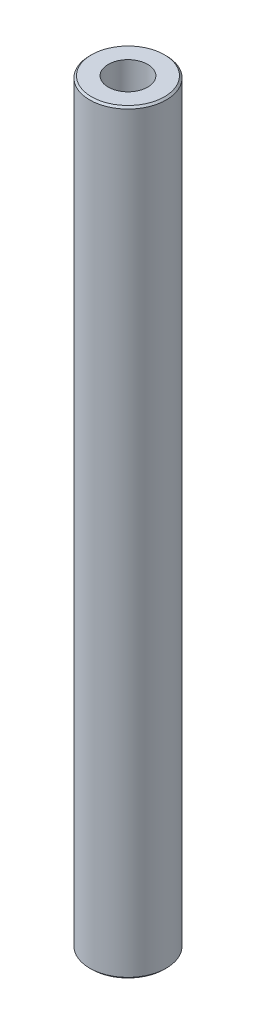
ISO-10303-21;
HEADER;
FILE_DESCRIPTION(('STEP AP214'),'2;1');
FILE_NAME('part.step','',(''),(''),'','','');
FILE_SCHEMA(('AUTOMOTIVE_DESIGN { 1 0 10303 214 1 1 1 1 }'));
ENDSEC;
DATA;
#1=APPLICATION_CONTEXT('core data for automotive mechanical design processes');
#2=APPLICATION_PROTOCOL_DEFINITION('international standard','automotive_design',2000,#1);
#3=PRODUCT_CONTEXT('',#1,'mechanical');
#4=PRODUCT('Part','Part','',(#3));
#5=PRODUCT_RELATED_PRODUCT_CATEGORY('part','',(#4));
#6=PRODUCT_DEFINITION_FORMATION('','',#4);
#7=PRODUCT_DEFINITION_CONTEXT('part definition',#1,'design');
#8=PRODUCT_DEFINITION('design','',#6,#7);
#9=PRODUCT_DEFINITION_SHAPE('','',#8);
#10=(LENGTH_UNIT() NAMED_UNIT(*) SI_UNIT(.MILLI.,.METRE.));
#11=(NAMED_UNIT(*) PLANE_ANGLE_UNIT() SI_UNIT($,.RADIAN.));
#12=(NAMED_UNIT(*) SI_UNIT($,.STERADIAN.) SOLID_ANGLE_UNIT());
#13=UNCERTAINTY_MEASURE_WITH_UNIT(LENGTH_MEASURE(1.E-05),#10,'distance_accuracy_value','');
#14=(GEOMETRIC_REPRESENTATION_CONTEXT(3) GLOBAL_UNCERTAINTY_ASSIGNED_CONTEXT((#13)) GLOBAL_UNIT_ASSIGNED_CONTEXT((#10,
#11,#12)) REPRESENTATION_CONTEXT('',''));
#15=CARTESIAN_POINT('',(0.,0.,0.));
#16=DIRECTION('',(0.,0.,1.));
#17=DIRECTION('',(1.,0.,0.));
#18=AXIS2_PLACEMENT_3D('',#15,#16,#17);
#19=CARTESIAN_POINT('',(0.,148.099825363916,0.));
#20=DIRECTION('',(0.,-1.,0.));
#21=DIRECTION('',(0.,0.,-1.));
#22=AXIS2_PLACEMENT_3D('',#19,#20,#21);
#23=CYLINDRICAL_SURFACE('',#22,7.5);
#24=CARTESIAN_POINT('',(0.,147.742356770073,0.));
#25=DIRECTION('',(0.,1.,0.));
#26=DIRECTION('',(0.,0.,1.));
#27=AXIS2_PLACEMENT_3D('',#24,#25,#26);
#28=CIRCLE('',#27,7.5);
#29=CARTESIAN_POINT('',(0.,147.742356770073,7.5));
#30=VERTEX_POINT('',#29);
#31=EDGE_CURVE('E50',#30,#30,#28,.F.);
#32=ORIENTED_EDGE('',*,*,#31,.T.);
#33=EDGE_LOOP('',(#32));
#34=FACE_BOUND('',#33,.T.);
#35=CARTESIAN_POINT('',(0.,0.357468593843113,0.));
#36=DIRECTION('',(0.,1.,0.));
#37=DIRECTION('',(0.,0.,1.));
#38=AXIS2_PLACEMENT_3D('',#35,#36,#37);
#39=CIRCLE('',#38,7.5);
#40=CARTESIAN_POINT('',(0.,0.357468593843113,7.5));
#41=VERTEX_POINT('',#40);
#42=EDGE_CURVE('E51',#41,#41,#39,.T.);
#43=ORIENTED_EDGE('',*,*,#42,.T.);
#44=EDGE_LOOP('',(#43));
#45=FACE_BOUND('',#44,.T.);
#46=ADVANCED_FACE('F39',(#34,#45),#23,.T.);
#47=CARTESIAN_POINT('',(0.,148.099825363916,0.));
#48=DIRECTION('',(0.,1.,0.));
#49=DIRECTION('',(0.,0.,1.));
#50=AXIS2_PLACEMENT_3D('',#47,#48,#49);
#51=PLANE('',#50);
#52=CARTESIAN_POINT('',(0.,148.099825363916,0.));
#53=DIRECTION('',(0.,1.,0.));
#54=DIRECTION('',(0.,0.,1.));
#55=AXIS2_PLACEMENT_3D('',#52,#53,#54);
#56=CIRCLE('',#55,7.14253140615681);
#57=CARTESIAN_POINT('',(0.,148.099825363916,7.14253140615681));
#58=VERTEX_POINT('',#57);
#59=EDGE_CURVE('E54',#58,#58,#56,.T.);
#60=ORIENTED_EDGE('',*,*,#59,.T.);
#61=EDGE_LOOP('',(#60));
#62=FACE_BOUND('',#61,.T.);
#63=CARTESIAN_POINT('',(0.,148.099825363916,0.));
#64=DIRECTION('',(0.,1.,0.));
#65=DIRECTION('',(0.,0.,1.));
#66=AXIS2_PLACEMENT_3D('',#63,#64,#65);
#67=CIRCLE('',#66,3.8721030060679);
#68=CARTESIAN_POINT('',(0.,148.099825363916,3.8721030060679));
#69=VERTEX_POINT('',#68);
#70=EDGE_CURVE('E58',#69,#69,#67,.T.);
#71=ORIENTED_EDGE('',*,*,#70,.F.);
#72=EDGE_LOOP('',(#71));
#73=FACE_BOUND('',#72,.T.);
#74=ADVANCED_FACE('F69',(#62,#73),#51,.T.);
#75=CARTESIAN_POINT('',(0.,0.,0.));
#76=DIRECTION('',(0.,1.,0.));
#77=DIRECTION('',(0.,0.,1.));
#78=AXIS2_PLACEMENT_3D('',#75,#76,#77);
#79=PLANE('',#78);
#80=CARTESIAN_POINT('',(0.,0.,0.));
#81=DIRECTION('',(0.,1.,0.));
#82=DIRECTION('',(0.,0.,1.));
#83=AXIS2_PLACEMENT_3D('',#80,#81,#82);
#84=CIRCLE('',#83,7.14253140615687);
#85=CARTESIAN_POINT('',(0.,0.,7.14253140615687));
#86=VERTEX_POINT('',#85);
#87=EDGE_CURVE('E10',#86,#86,#84,.F.);
#88=ORIENTED_EDGE('',*,*,#87,.T.);
#89=EDGE_LOOP('',(#88));
#90=FACE_BOUND('',#89,.T.);
#91=CARTESIAN_POINT('',(0.,0.,0.));
#92=DIRECTION('',(0.,1.,0.));
#93=DIRECTION('',(0.,0.,1.));
#94=AXIS2_PLACEMENT_3D('',#91,#92,#93);
#95=CIRCLE('',#94,3.8721030060679);
#96=CARTESIAN_POINT('',(0.,0.,3.8721030060679));
#97=VERTEX_POINT('',#96);
#98=EDGE_CURVE('E63',#97,#97,#95,.T.);
#99=ORIENTED_EDGE('',*,*,#98,.T.);
#100=EDGE_LOOP('',(#99));
#101=FACE_BOUND('',#100,.T.);
#102=ADVANCED_FACE('F75',(#90,#101),#79,.F.);
#103=CARTESIAN_POINT('',(0.,148.099825363916,0.));
#104=DIRECTION('',(0.,-1.,0.));
#105=DIRECTION('',(0.,0.,-1.));
#106=AXIS2_PLACEMENT_3D('',#103,#104,#105);
#107=CYLINDRICAL_SURFACE('',#106,3.8721030060679);
#108=ORIENTED_EDGE('',*,*,#70,.T.);
#109=EDGE_LOOP('',(#108));
#110=FACE_BOUND('',#109,.T.);
#111=ORIENTED_EDGE('',*,*,#98,.F.);
#112=EDGE_LOOP('',(#111));
#113=FACE_BOUND('',#112,.T.);
#114=ADVANCED_FACE('F70',(#110,#113),#107,.F.);
#115=CARTESIAN_POINT('',(0.,148.099825363916,0.));
#116=DIRECTION('',(0.,-1.,0.));
#117=DIRECTION('',(0.,0.,-1.));
#118=AXIS2_PLACEMENT_3D('',#115,#116,#117);
#119=CONICAL_SURFACE('',#118,7.14253140615681,0.785398163397437);
#120=ORIENTED_EDGE('',*,*,#31,.F.);
#121=EDGE_LOOP('',(#120));
#122=FACE_BOUND('',#121,.T.);
#123=ORIENTED_EDGE('',*,*,#59,.F.);
#124=EDGE_LOOP('',(#123));
#125=FACE_BOUND('',#124,.T.);
#126=ADVANCED_FACE('F81',(#122,#125),#119,.T.);
#127=CARTESIAN_POINT('',(0.,0.357468593843113,0.));
#128=DIRECTION('',(0.,1.,0.));
#129=DIRECTION('',(0.,0.,1.));
#130=AXIS2_PLACEMENT_3D('',#127,#128,#129);
#131=CONICAL_SURFACE('',#130,7.5,0.785398163397477);
#132=ORIENTED_EDGE('',*,*,#87,.F.);
#133=EDGE_LOOP('',(#132));
#134=FACE_BOUND('',#133,.T.);
#135=ORIENTED_EDGE('',*,*,#42,.F.);
#136=EDGE_LOOP('',(#135));
#137=FACE_BOUND('',#136,.T.);
#138=ADVANCED_FACE('F45',(#134,#137),#131,.T.);
#139=CLOSED_SHELL('',(#46,#74,#102,#114,#126,#138));
#140=MANIFOLD_SOLID_BREP('B2',#139);
#141=ADVANCED_BREP_SHAPE_REPRESENTATION('',(#18,#140),#14);
#142=SHAPE_DEFINITION_REPRESENTATION(#9,#141);
ENDSEC;
END-ISO-10303-21;
